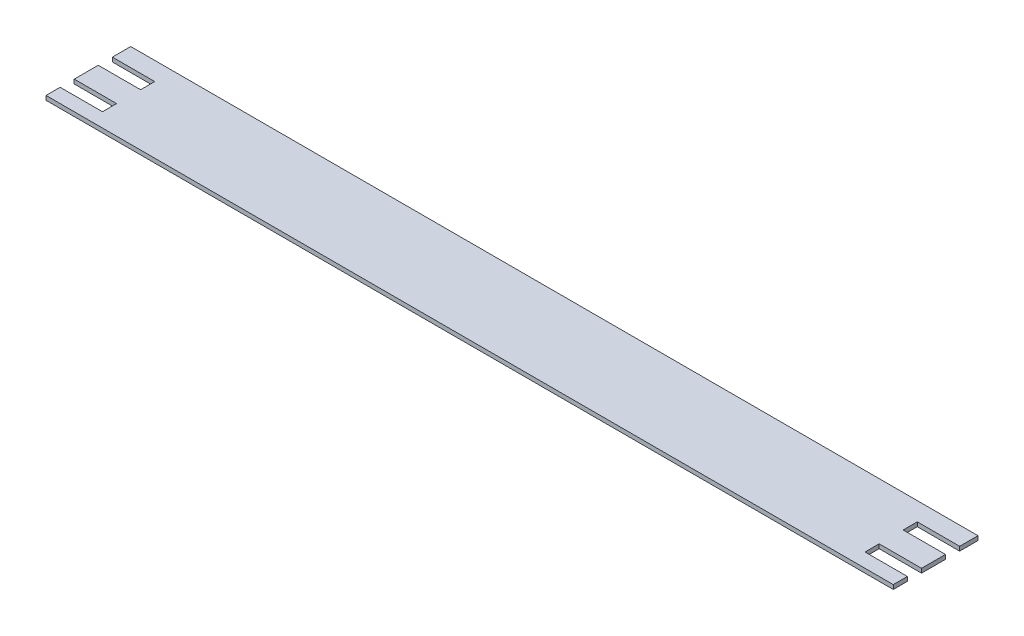
ISO-10303-21;
HEADER;
FILE_DESCRIPTION(('STEP AP214'),'2;1');
FILE_NAME('part.step','',(''),(''),'','','');
FILE_SCHEMA(('AUTOMOTIVE_DESIGN { 1 0 10303 214 1 1 1 1 }'));
ENDSEC;
DATA;
#1=APPLICATION_CONTEXT('core data for automotive mechanical design processes');
#2=APPLICATION_PROTOCOL_DEFINITION('international standard','automotive_design',2000,#1);
#3=PRODUCT_CONTEXT('',#1,'mechanical');
#4=PRODUCT('Part','Part','',(#3));
#5=PRODUCT_RELATED_PRODUCT_CATEGORY('part','',(#4));
#6=PRODUCT_DEFINITION_FORMATION('','',#4);
#7=PRODUCT_DEFINITION_CONTEXT('part definition',#1,'design');
#8=PRODUCT_DEFINITION('design','',#6,#7);
#9=PRODUCT_DEFINITION_SHAPE('','',#8);
#10=(LENGTH_UNIT() NAMED_UNIT(*) SI_UNIT(.MILLI.,.METRE.));
#11=(NAMED_UNIT(*) PLANE_ANGLE_UNIT() SI_UNIT($,.RADIAN.));
#12=(NAMED_UNIT(*) SI_UNIT($,.STERADIAN.) SOLID_ANGLE_UNIT());
#13=UNCERTAINTY_MEASURE_WITH_UNIT(LENGTH_MEASURE(1.E-05),#10,'distance_accuracy_value','');
#14=(GEOMETRIC_REPRESENTATION_CONTEXT(3) GLOBAL_UNCERTAINTY_ASSIGNED_CONTEXT((#13)) GLOBAL_UNIT_ASSIGNED_CONTEXT((#10,
#11,#12)) REPRESENTATION_CONTEXT('',''));
#15=CARTESIAN_POINT('',(0.,0.,0.));
#16=DIRECTION('',(0.,0.,1.));
#17=DIRECTION('',(1.,0.,0.));
#18=AXIS2_PLACEMENT_3D('',#15,#16,#17);
#19=CARTESIAN_POINT('',(-300.,46.99,23.));
#20=DIRECTION('',(0.,0.,1.));
#21=DIRECTION('',(1.,0.,0.));
#22=AXIS2_PLACEMENT_3D('',#19,#20,#21);
#23=PLANE('',#22);
#24=DIRECTION('',(0.,1.,0.));
#25=VECTOR('',#24,1.);
#26=CARTESIAN_POINT('',(-300.,0.,23.));
#27=LINE('',#26,#25);
#28=CARTESIAN_POINT('',(-300.,47.,23.));
#29=VERTEX_POINT('',#28);
#30=CARTESIAN_POINT('',(-300.,50.,23.));
#31=VERTEX_POINT('',#30);
#32=EDGE_CURVE('E196',#29,#31,#27,.T.);
#33=ORIENTED_EDGE('',*,*,#32,.T.);
#34=DIRECTION('',(-1.,0.,0.));
#35=VECTOR('',#34,1.);
#36=CARTESIAN_POINT('',(-300.,50.,23.));
#37=LINE('',#36,#35);
#38=CARTESIAN_POINT('',(-270.,50.,23.));
#39=VERTEX_POINT('',#38);
#40=EDGE_CURVE('E278',#39,#31,#37,.T.);
#41=ORIENTED_EDGE('',*,*,#40,.F.);
#42=DIRECTION('',(0.,1.,0.));
#43=VECTOR('',#42,1.);
#44=CARTESIAN_POINT('',(-270.,46.99,23.));
#45=LINE('',#44,#43);
#46=CARTESIAN_POINT('',(-270.,47.,23.));
#47=VERTEX_POINT('',#46);
#48=EDGE_CURVE('E258',#47,#39,#45,.T.);
#49=ORIENTED_EDGE('',*,*,#48,.F.);
#50=DIRECTION('',(1.,0.,0.));
#51=VECTOR('',#50,1.);
#52=CARTESIAN_POINT('',(300.,47.,22.9999999999999));
#53=LINE('',#52,#51);
#54=EDGE_CURVE('E269',#29,#47,#53,.T.);
#55=ORIENTED_EDGE('',*,*,#54,.F.);
#56=EDGE_LOOP('',(#33,#41,#49,#55));
#57=FACE_BOUND('',#56,.T.);
#58=ADVANCED_FACE('F35',(#57),#23,.F.);
#59=CARTESIAN_POINT('',(-300.,46.99,13.));
#60=DIRECTION('',(0.,0.,-1.));
#61=DIRECTION('',(-1.,0.,0.));
#62=AXIS2_PLACEMENT_3D('',#59,#60,#61);
#63=PLANE('',#62);
#64=DIRECTION('',(0.,1.,0.));
#65=VECTOR('',#64,1.);
#66=CARTESIAN_POINT('',(-270.,46.99,13.));
#67=LINE('',#66,#65);
#68=CARTESIAN_POINT('',(-270.,47.,13.));
#69=VERTEX_POINT('',#68);
#70=CARTESIAN_POINT('',(-270.,50.,13.));
#71=VERTEX_POINT('',#70);
#72=EDGE_CURVE('E39',#69,#71,#67,.T.);
#73=ORIENTED_EDGE('',*,*,#72,.T.);
#74=DIRECTION('',(1.,0.,0.));
#75=VECTOR('',#74,1.);
#76=CARTESIAN_POINT('',(-300.,50.,13.));
#77=LINE('',#76,#75);
#78=CARTESIAN_POINT('',(-300.,50.,13.));
#79=VERTEX_POINT('',#78);
#80=EDGE_CURVE('E193',#79,#71,#77,.T.);
#81=ORIENTED_EDGE('',*,*,#80,.F.);
#82=DIRECTION('',(0.,-1.,0.));
#83=VECTOR('',#82,1.);
#84=CARTESIAN_POINT('',(-300.,0.,13.));
#85=LINE('',#84,#83);
#86=CARTESIAN_POINT('',(-300.,47.,13.));
#87=VERTEX_POINT('',#86);
#88=EDGE_CURVE('E191',#79,#87,#85,.T.);
#89=ORIENTED_EDGE('',*,*,#88,.T.);
#90=DIRECTION('',(-1.,0.,0.));
#91=VECTOR('',#90,1.);
#92=CARTESIAN_POINT('',(300.,47.,13.));
#93=LINE('',#92,#91);
#94=EDGE_CURVE('E177',#69,#87,#93,.T.);
#95=ORIENTED_EDGE('',*,*,#94,.F.);
#96=EDGE_LOOP('',(#73,#81,#89,#95));
#97=FACE_BOUND('',#96,.T.);
#98=ADVANCED_FACE('F192',(#97),#63,.F.);
#99=CARTESIAN_POINT('',(-270.,46.99,13.));
#100=DIRECTION('',(1.,0.,0.));
#101=DIRECTION('',(0.,0.,-1.));
#102=AXIS2_PLACEMENT_3D('',#99,#100,#101);
#103=PLANE('',#102);
#104=ORIENTED_EDGE('',*,*,#48,.T.);
#105=DIRECTION('',(0.,0.,1.));
#106=VECTOR('',#105,1.);
#107=CARTESIAN_POINT('',(-270.,50.,60.));
#108=LINE('',#107,#106);
#109=EDGE_CURVE('E372',#71,#39,#108,.T.);
#110=ORIENTED_EDGE('',*,*,#109,.F.);
#111=ORIENTED_EDGE('',*,*,#72,.F.);
#112=DIRECTION('',(0.,0.,-1.));
#113=VECTOR('',#112,1.);
#114=CARTESIAN_POINT('',(-270.,47.,3.));
#115=LINE('',#114,#113);
#116=EDGE_CURVE('E184',#47,#69,#115,.T.);
#117=ORIENTED_EDGE('',*,*,#116,.F.);
#118=EDGE_LOOP('',(#104,#110,#111,#117));
#119=FACE_BOUND('',#118,.T.);
#120=ADVANCED_FACE('F376',(#119),#103,.F.);
#121=CARTESIAN_POINT('',(-300.,46.99,50.));
#122=DIRECTION('',(0.,0.,1.));
#123=DIRECTION('',(1.,0.,0.));
#124=AXIS2_PLACEMENT_3D('',#121,#122,#123);
#125=PLANE('',#124);
#126=DIRECTION('',(0.,1.,0.));
#127=VECTOR('',#126,1.);
#128=CARTESIAN_POINT('',(-300.,0.,50.));
#129=LINE('',#128,#127);
#130=CARTESIAN_POINT('',(-300.,47.,50.));
#131=VERTEX_POINT('',#130);
#132=CARTESIAN_POINT('',(-300.,50.,50.));
#133=VERTEX_POINT('',#132);
#134=EDGE_CURVE('E197',#131,#133,#129,.T.);
#135=ORIENTED_EDGE('',*,*,#134,.T.);
#136=DIRECTION('',(-1.,0.,0.));
#137=VECTOR('',#136,1.);
#138=CARTESIAN_POINT('',(-300.,50.,50.));
#139=LINE('',#138,#137);
#140=CARTESIAN_POINT('',(-270.,50.,50.));
#141=VERTEX_POINT('',#140);
#142=EDGE_CURVE('E235',#141,#133,#139,.T.);
#143=ORIENTED_EDGE('',*,*,#142,.F.);
#144=DIRECTION('',(0.,1.,0.));
#145=VECTOR('',#144,1.);
#146=CARTESIAN_POINT('',(-270.,46.99,50.));
#147=LINE('',#146,#145);
#148=CARTESIAN_POINT('',(-270.,47.,50.));
#149=VERTEX_POINT('',#148);
#150=EDGE_CURVE('E318',#149,#141,#147,.T.);
#151=ORIENTED_EDGE('',*,*,#150,.F.);
#152=DIRECTION('',(1.,0.,0.));
#153=VECTOR('',#152,1.);
#154=CARTESIAN_POINT('',(300.,47.,50.));
#155=LINE('',#154,#153);
#156=EDGE_CURVE('E188',#131,#149,#155,.T.);
#157=ORIENTED_EDGE('',*,*,#156,.F.);
#158=EDGE_LOOP('',(#135,#143,#151,#157));
#159=FACE_BOUND('',#158,.T.);
#160=ADVANCED_FACE('F336',(#159),#125,.F.);
#161=CARTESIAN_POINT('',(-300.,46.99,40.));
#162=DIRECTION('',(0.,0.,-1.));
#163=DIRECTION('',(-1.,0.,0.));
#164=AXIS2_PLACEMENT_3D('',#161,#162,#163);
#165=PLANE('',#164);
#166=DIRECTION('',(0.,1.,0.));
#167=VECTOR('',#166,1.);
#168=CARTESIAN_POINT('',(-270.,46.99,40.));
#169=LINE('',#168,#167);
#170=CARTESIAN_POINT('',(-270.,47.,40.));
#171=VERTEX_POINT('',#170);
#172=CARTESIAN_POINT('',(-270.,50.,40.));
#173=VERTEX_POINT('',#172);
#174=EDGE_CURVE('E291',#171,#173,#169,.T.);
#175=ORIENTED_EDGE('',*,*,#174,.T.);
#176=DIRECTION('',(1.,0.,0.));
#177=VECTOR('',#176,1.);
#178=CARTESIAN_POINT('',(-300.,50.,40.));
#179=LINE('',#178,#177);
#180=CARTESIAN_POINT('',(-300.,50.,40.));
#181=VERTEX_POINT('',#180);
#182=EDGE_CURVE('E229',#181,#173,#179,.T.);
#183=ORIENTED_EDGE('',*,*,#182,.F.);
#184=DIRECTION('',(0.,-1.,0.));
#185=VECTOR('',#184,1.);
#186=CARTESIAN_POINT('',(-300.,0.,40.));
#187=LINE('',#186,#185);
#188=CARTESIAN_POINT('',(-300.,47.,40.));
#189=VERTEX_POINT('',#188);
#190=EDGE_CURVE('E245',#181,#189,#187,.T.);
#191=ORIENTED_EDGE('',*,*,#190,.T.);
#192=DIRECTION('',(-1.,0.,0.));
#193=VECTOR('',#192,1.);
#194=CARTESIAN_POINT('',(300.,47.,40.));
#195=LINE('',#194,#193);
#196=EDGE_CURVE('E237',#171,#189,#195,.T.);
#197=ORIENTED_EDGE('',*,*,#196,.F.);
#198=EDGE_LOOP('',(#175,#183,#191,#197));
#199=FACE_BOUND('',#198,.T.);
#200=ADVANCED_FACE('F326',(#199),#165,.F.);
#201=CARTESIAN_POINT('',(-270.,46.99,40.));
#202=DIRECTION('',(1.,0.,0.));
#203=DIRECTION('',(0.,0.,-1.));
#204=AXIS2_PLACEMENT_3D('',#201,#202,#203);
#205=PLANE('',#204);
#206=ORIENTED_EDGE('',*,*,#150,.T.);
#207=DIRECTION('',(0.,0.,1.));
#208=VECTOR('',#207,1.);
#209=CARTESIAN_POINT('',(-270.,50.,60.));
#210=LINE('',#209,#208);
#211=EDGE_CURVE('E232',#173,#141,#210,.T.);
#212=ORIENTED_EDGE('',*,*,#211,.F.);
#213=ORIENTED_EDGE('',*,*,#174,.F.);
#214=DIRECTION('',(0.,0.,-1.));
#215=VECTOR('',#214,1.);
#216=CARTESIAN_POINT('',(-270.,47.,3.));
#217=LINE('',#216,#215);
#218=EDGE_CURVE('E240',#149,#171,#217,.T.);
#219=ORIENTED_EDGE('',*,*,#218,.F.);
#220=EDGE_LOOP('',(#206,#212,#213,#219));
#221=FACE_BOUND('',#220,.T.);
#222=ADVANCED_FACE('F328',(#221),#205,.F.);
#223=CARTESIAN_POINT('',(300.,46.99,13.));
#224=DIRECTION('',(0.,0.,-1.));
#225=DIRECTION('',(-1.,0.,0.));
#226=AXIS2_PLACEMENT_3D('',#223,#224,#225);
#227=PLANE('',#226);
#228=DIRECTION('',(0.,-1.,0.));
#229=VECTOR('',#228,1.);
#230=CARTESIAN_POINT('',(300.,1.71683972880179E-13,13.));
#231=LINE('',#230,#229);
#232=CARTESIAN_POINT('',(300.,50.,13.));
#233=VERTEX_POINT('',#232);
#234=CARTESIAN_POINT('',(300.,47.,13.));
#235=VERTEX_POINT('',#234);
#236=EDGE_CURVE('E279',#233,#235,#231,.T.);
#237=ORIENTED_EDGE('',*,*,#236,.F.);
#238=DIRECTION('',(1.,0.,0.));
#239=VECTOR('',#238,1.);
#240=CARTESIAN_POINT('',(-300.,50.,13.));
#241=LINE('',#240,#239);
#242=CARTESIAN_POINT('',(270.,50.,13.));
#243=VERTEX_POINT('',#242);
#244=EDGE_CURVE('E270',#243,#233,#241,.T.);
#245=ORIENTED_EDGE('',*,*,#244,.F.);
#246=DIRECTION('',(0.,1.,0.));
#247=VECTOR('',#246,1.);
#248=CARTESIAN_POINT('',(270.,46.99,13.));
#249=LINE('',#248,#247);
#250=CARTESIAN_POINT('',(270.,47.,13.));
#251=VERTEX_POINT('',#250);
#252=EDGE_CURVE('E247',#251,#243,#249,.T.);
#253=ORIENTED_EDGE('',*,*,#252,.F.);
#254=DIRECTION('',(-1.,0.,0.));
#255=VECTOR('',#254,1.);
#256=CARTESIAN_POINT('',(300.,47.,13.));
#257=LINE('',#256,#255);
#258=EDGE_CURVE('E262',#235,#251,#257,.T.);
#259=ORIENTED_EDGE('',*,*,#258,.F.);
#260=EDGE_LOOP('',(#237,#245,#253,#259));
#261=FACE_BOUND('',#260,.T.);
#262=ADVANCED_FACE('F399',(#261),#227,.F.);
#263=CARTESIAN_POINT('',(300.,46.99,23.));
#264=DIRECTION('',(0.,0.,1.));
#265=DIRECTION('',(1.,0.,0.));
#266=AXIS2_PLACEMENT_3D('',#263,#264,#265);
#267=PLANE('',#266);
#268=DIRECTION('',(0.,1.,0.));
#269=VECTOR('',#268,1.);
#270=CARTESIAN_POINT('',(270.,46.99,23.));
#271=LINE('',#270,#269);
#272=CARTESIAN_POINT('',(270.,47.,23.));
#273=VERTEX_POINT('',#272);
#274=CARTESIAN_POINT('',(270.,50.,23.));
#275=VERTEX_POINT('',#274);
#276=EDGE_CURVE('E251',#273,#275,#271,.T.);
#277=ORIENTED_EDGE('',*,*,#276,.T.);
#278=DIRECTION('',(-1.,0.,0.));
#279=VECTOR('',#278,1.);
#280=CARTESIAN_POINT('',(-300.,50.,23.));
#281=LINE('',#280,#279);
#282=CARTESIAN_POINT('',(300.,50.,23.));
#283=VERTEX_POINT('',#282);
#284=EDGE_CURVE('E276',#283,#275,#281,.T.);
#285=ORIENTED_EDGE('',*,*,#284,.F.);
#286=DIRECTION('',(0.,1.,0.));
#287=VECTOR('',#286,1.);
#288=CARTESIAN_POINT('',(300.,1.71683972880179E-13,23.));
#289=LINE('',#288,#287);
#290=CARTESIAN_POINT('',(300.,47.,23.));
#291=VERTEX_POINT('',#290);
#292=EDGE_CURVE('E282',#291,#283,#289,.T.);
#293=ORIENTED_EDGE('',*,*,#292,.F.);
#294=DIRECTION('',(1.,0.,0.));
#295=VECTOR('',#294,1.);
#296=CARTESIAN_POINT('',(300.,47.,23.));
#297=LINE('',#296,#295);
#298=EDGE_CURVE('E267',#273,#291,#297,.T.);
#299=ORIENTED_EDGE('',*,*,#298,.F.);
#300=EDGE_LOOP('',(#277,#285,#293,#299));
#301=FACE_BOUND('',#300,.T.);
#302=ADVANCED_FACE('F404',(#301),#267,.F.);
#303=CARTESIAN_POINT('',(270.,46.99,13.));
#304=DIRECTION('',(-1.,0.,0.));
#305=DIRECTION('',(0.,0.,1.));
#306=AXIS2_PLACEMENT_3D('',#303,#304,#305);
#307=PLANE('',#306);
#308=ORIENTED_EDGE('',*,*,#252,.T.);
#309=DIRECTION('',(0.,0.,-1.));
#310=VECTOR('',#309,1.);
#311=CARTESIAN_POINT('',(270.,50.,60.));
#312=LINE('',#311,#310);
#313=EDGE_CURVE('E272',#275,#243,#312,.T.);
#314=ORIENTED_EDGE('',*,*,#313,.F.);
#315=ORIENTED_EDGE('',*,*,#276,.F.);
#316=DIRECTION('',(0.,0.,1.));
#317=VECTOR('',#316,1.);
#318=CARTESIAN_POINT('',(270.,47.,3.));
#319=LINE('',#318,#317);
#320=EDGE_CURVE('E264',#251,#273,#319,.T.);
#321=ORIENTED_EDGE('',*,*,#320,.F.);
#322=EDGE_LOOP('',(#308,#314,#315,#321));
#323=FACE_BOUND('',#322,.T.);
#324=ADVANCED_FACE('F408',(#323),#307,.F.);
#325=CARTESIAN_POINT('',(300.,46.99,40.));
#326=DIRECTION('',(0.,0.,-1.));
#327=DIRECTION('',(-1.,0.,0.));
#328=AXIS2_PLACEMENT_3D('',#325,#326,#327);
#329=PLANE('',#328);
#330=DIRECTION('',(0.,-1.,0.));
#331=VECTOR('',#330,1.);
#332=CARTESIAN_POINT('',(300.,1.71683972880179E-13,40.));
#333=LINE('',#332,#331);
#334=CARTESIAN_POINT('',(300.,50.,40.));
#335=VERTEX_POINT('',#334);
#336=CARTESIAN_POINT('',(300.,47.,40.));
#337=VERTEX_POINT('',#336);
#338=EDGE_CURVE('E207',#335,#337,#333,.T.);
#339=ORIENTED_EDGE('',*,*,#338,.F.);
#340=DIRECTION('',(1.,0.,0.));
#341=VECTOR('',#340,1.);
#342=CARTESIAN_POINT('',(-300.,50.,40.));
#343=LINE('',#342,#341);
#344=CARTESIAN_POINT('',(270.,50.,40.));
#345=VERTEX_POINT('',#344);
#346=EDGE_CURVE('E231',#345,#335,#343,.T.);
#347=ORIENTED_EDGE('',*,*,#346,.F.);
#348=DIRECTION('',(0.,1.,0.));
#349=VECTOR('',#348,1.);
#350=CARTESIAN_POINT('',(270.,46.99,40.));
#351=LINE('',#350,#349);
#352=CARTESIAN_POINT('',(270.,47.,40.));
#353=VERTEX_POINT('',#352);
#354=EDGE_CURVE('E288',#353,#345,#351,.T.);
#355=ORIENTED_EDGE('',*,*,#354,.F.);
#356=DIRECTION('',(-1.,0.,0.));
#357=VECTOR('',#356,1.);
#358=CARTESIAN_POINT('',(300.,47.,40.));
#359=LINE('',#358,#357);
#360=EDGE_CURVE('E239',#337,#353,#359,.T.);
#361=ORIENTED_EDGE('',*,*,#360,.F.);
#362=EDGE_LOOP('',(#339,#347,#355,#361));
#363=FACE_BOUND('',#362,.T.);
#364=ADVANCED_FACE('F359',(#363),#329,.F.);
#365=CARTESIAN_POINT('',(300.,46.99,50.));
#366=DIRECTION('',(0.,0.,1.));
#367=DIRECTION('',(1.,0.,0.));
#368=AXIS2_PLACEMENT_3D('',#365,#366,#367);
#369=PLANE('',#368);
#370=DIRECTION('',(0.,1.,0.));
#371=VECTOR('',#370,1.);
#372=CARTESIAN_POINT('',(270.,46.99,50.));
#373=LINE('',#372,#371);
#374=CARTESIAN_POINT('',(270.,47.,50.));
#375=VERTEX_POINT('',#374);
#376=CARTESIAN_POINT('',(270.,50.,50.));
#377=VERTEX_POINT('',#376);
#378=EDGE_CURVE('E285',#375,#377,#373,.T.);
#379=ORIENTED_EDGE('',*,*,#378,.T.);
#380=DIRECTION('',(-1.,0.,0.));
#381=VECTOR('',#380,1.);
#382=CARTESIAN_POINT('',(-300.,50.,50.));
#383=LINE('',#382,#381);
#384=CARTESIAN_POINT('',(300.,50.,50.));
#385=VERTEX_POINT('',#384);
#386=EDGE_CURVE('E283',#385,#377,#383,.T.);
#387=ORIENTED_EDGE('',*,*,#386,.F.);
#388=DIRECTION('',(0.,1.,0.));
#389=VECTOR('',#388,1.);
#390=CARTESIAN_POINT('',(300.,1.71683972880179E-13,50.));
#391=LINE('',#390,#389);
#392=CARTESIAN_POINT('',(300.,47.,50.));
#393=VERTEX_POINT('',#392);
#394=EDGE_CURVE('E204',#393,#385,#391,.T.);
#395=ORIENTED_EDGE('',*,*,#394,.F.);
#396=DIRECTION('',(1.,0.,0.));
#397=VECTOR('',#396,1.);
#398=CARTESIAN_POINT('',(300.,47.,50.));
#399=LINE('',#398,#397);
#400=EDGE_CURVE('E273',#375,#393,#399,.T.);
#401=ORIENTED_EDGE('',*,*,#400,.F.);
#402=EDGE_LOOP('',(#379,#387,#395,#401));
#403=FACE_BOUND('',#402,.T.);
#404=ADVANCED_FACE('F348',(#403),#369,.F.);
#405=CARTESIAN_POINT('',(270.,46.99,40.));
#406=DIRECTION('',(-1.,0.,0.));
#407=DIRECTION('',(0.,0.,1.));
#408=AXIS2_PLACEMENT_3D('',#405,#406,#407);
#409=PLANE('',#408);
#410=ORIENTED_EDGE('',*,*,#354,.T.);
#411=DIRECTION('',(0.,0.,-1.));
#412=VECTOR('',#411,1.);
#413=CARTESIAN_POINT('',(270.,50.,60.));
#414=LINE('',#413,#412);
#415=EDGE_CURVE('E307',#377,#345,#414,.T.);
#416=ORIENTED_EDGE('',*,*,#415,.F.);
#417=ORIENTED_EDGE('',*,*,#378,.F.);
#418=DIRECTION('',(0.,0.,1.));
#419=VECTOR('',#418,1.);
#420=CARTESIAN_POINT('',(270.,47.,3.));
#421=LINE('',#420,#419);
#422=EDGE_CURVE('E302',#353,#375,#421,.T.);
#423=ORIENTED_EDGE('',*,*,#422,.F.);
#424=EDGE_LOOP('',(#410,#416,#417,#423));
#425=FACE_BOUND('',#424,.T.);
#426=ADVANCED_FACE('F353',(#425),#409,.F.);
#427=CARTESIAN_POINT('',(-300.,0.,0.));
#428=DIRECTION('',(0.,0.,1.));
#429=DIRECTION('',(1.,0.,0.));
#430=AXIS2_PLACEMENT_3D('',#427,#428,#429);
#431=PLANE('',#430);
#432=DIRECTION('',(0.,-1.,0.));
#433=VECTOR('',#432,1.);
#434=CARTESIAN_POINT('',(-300.,0.,0.));
#435=LINE('',#434,#433);
#436=CARTESIAN_POINT('',(-300.,50.,0.));
#437=VERTEX_POINT('',#436);
#438=CARTESIAN_POINT('',(-300.,47.,0.));
#439=VERTEX_POINT('',#438);
#440=EDGE_CURVE('E202',#437,#439,#435,.T.);
#441=ORIENTED_EDGE('',*,*,#440,.F.);
#442=DIRECTION('',(-1.,0.,0.));
#443=VECTOR('',#442,1.);
#444=CARTESIAN_POINT('',(-300.,50.,0.));
#445=LINE('',#444,#443);
#446=CARTESIAN_POINT('',(300.,50.,0.));
#447=VERTEX_POINT('',#446);
#448=EDGE_CURVE('E295',#447,#437,#445,.T.);
#449=ORIENTED_EDGE('',*,*,#448,.F.);
#450=DIRECTION('',(0.,-1.,0.));
#451=VECTOR('',#450,1.);
#452=CARTESIAN_POINT('',(300.,3.43367945760358E-13,0.));
#453=LINE('',#452,#451);
#454=CARTESIAN_POINT('',(300.,47.,0.));
#455=VERTEX_POINT('',#454);
#456=EDGE_CURVE('E216',#447,#455,#453,.T.);
#457=ORIENTED_EDGE('',*,*,#456,.T.);
#458=DIRECTION('',(1.,0.,0.));
#459=VECTOR('',#458,1.);
#460=CARTESIAN_POINT('',(-300.,47.,0.));
#461=LINE('',#460,#459);
#462=EDGE_CURVE('E218',#439,#455,#461,.T.);
#463=ORIENTED_EDGE('',*,*,#462,.F.);
#464=EDGE_LOOP('',(#441,#449,#457,#463));
#465=FACE_BOUND('',#464,.T.);
#466=ADVANCED_FACE('F387',(#465),#431,.F.);
#467=CARTESIAN_POINT('',(-300.,0.,60.));
#468=DIRECTION('',(0.,0.,1.));
#469=DIRECTION('',(1.,0.,0.));
#470=AXIS2_PLACEMENT_3D('',#467,#468,#469);
#471=PLANE('',#470);
#472=DIRECTION('',(-1.,0.,0.));
#473=VECTOR('',#472,1.);
#474=CARTESIAN_POINT('',(-300.,50.,60.));
#475=LINE('',#474,#473);
#476=CARTESIAN_POINT('',(300.,50.,60.));
#477=VERTEX_POINT('',#476);
#478=CARTESIAN_POINT('',(-300.,50.,60.));
#479=VERTEX_POINT('',#478);
#480=EDGE_CURVE('E224',#477,#479,#475,.T.);
#481=ORIENTED_EDGE('',*,*,#480,.T.);
#482=DIRECTION('',(0.,-1.,0.));
#483=VECTOR('',#482,1.);
#484=CARTESIAN_POINT('',(-300.,0.,60.));
#485=LINE('',#484,#483);
#486=CARTESIAN_POINT('',(-300.,47.,60.));
#487=VERTEX_POINT('',#486);
#488=EDGE_CURVE('E44',#479,#487,#485,.T.);
#489=ORIENTED_EDGE('',*,*,#488,.T.);
#490=DIRECTION('',(-1.,0.,0.));
#491=VECTOR('',#490,1.);
#492=CARTESIAN_POINT('',(300.,47.,60.));
#493=LINE('',#492,#491);
#494=CARTESIAN_POINT('',(300.,47.,60.));
#495=VERTEX_POINT('',#494);
#496=EDGE_CURVE('E225',#495,#487,#493,.T.);
#497=ORIENTED_EDGE('',*,*,#496,.F.);
#498=DIRECTION('',(0.,-1.,0.));
#499=VECTOR('',#498,1.);
#500=CARTESIAN_POINT('',(300.,3.43367945760358E-13,60.));
#501=LINE('',#500,#499);
#502=EDGE_CURVE('E11',#477,#495,#501,.T.);
#503=ORIENTED_EDGE('',*,*,#502,.F.);
#504=EDGE_LOOP('',(#481,#489,#497,#503));
#505=FACE_BOUND('',#504,.T.);
#506=ADVANCED_FACE('F342',(#505),#471,.T.);
#507=CARTESIAN_POINT('',(-300.,50.,60.));
#508=DIRECTION('',(0.,-1.,0.));
#509=DIRECTION('',(0.,0.,-1.));
#510=AXIS2_PLACEMENT_3D('',#507,#508,#509);
#511=PLANE('',#510);
#512=ORIENTED_EDGE('',*,*,#313,.T.);
#513=ORIENTED_EDGE('',*,*,#244,.T.);
#514=DIRECTION('',(0.,0.,-1.));
#515=VECTOR('',#514,1.);
#516=CARTESIAN_POINT('',(300.,50.,60.));
#517=LINE('',#516,#515);
#518=EDGE_CURVE('E300',#233,#447,#517,.T.);
#519=ORIENTED_EDGE('',*,*,#518,.T.);
#520=ORIENTED_EDGE('',*,*,#448,.T.);
#521=DIRECTION('',(0.,0.,-1.));
#522=VECTOR('',#521,1.);
#523=CARTESIAN_POINT('',(-300.,50.,60.));
#524=LINE('',#523,#522);
#525=EDGE_CURVE('E212',#79,#437,#524,.T.);
#526=ORIENTED_EDGE('',*,*,#525,.F.);
#527=ORIENTED_EDGE('',*,*,#80,.T.);
#528=ORIENTED_EDGE('',*,*,#109,.T.);
#529=ORIENTED_EDGE('',*,*,#40,.T.);
#530=EDGE_CURVE('E211',#181,#31,#524,.T.);
#531=ORIENTED_EDGE('',*,*,#530,.F.);
#532=ORIENTED_EDGE('',*,*,#182,.T.);
#533=ORIENTED_EDGE('',*,*,#211,.T.);
#534=ORIENTED_EDGE('',*,*,#142,.T.);
#535=EDGE_CURVE('E60',#479,#133,#524,.T.);
#536=ORIENTED_EDGE('',*,*,#535,.F.);
#537=ORIENTED_EDGE('',*,*,#480,.F.);
#538=EDGE_CURVE('E296',#477,#385,#517,.T.);
#539=ORIENTED_EDGE('',*,*,#538,.T.);
#540=ORIENTED_EDGE('',*,*,#386,.T.);
#541=ORIENTED_EDGE('',*,*,#415,.T.);
#542=ORIENTED_EDGE('',*,*,#346,.T.);
#543=EDGE_CURVE('E299',#335,#283,#517,.T.);
#544=ORIENTED_EDGE('',*,*,#543,.T.);
#545=ORIENTED_EDGE('',*,*,#284,.T.);
#546=EDGE_LOOP('',(#512,#513,#519,#520,#526,#527,#528,#529,#531,#532,#533,#534,#536,#537,#539,
#540,#541,#542,#544,#545));
#547=FACE_BOUND('',#546,.T.);
#548=ADVANCED_FACE('F329',(#547),#511,.F.);
#549=CARTESIAN_POINT('',(300.,47.,3.));
#550=DIRECTION('',(0.,1.,0.));
#551=DIRECTION('',(0.,0.,1.));
#552=AXIS2_PLACEMENT_3D('',#549,#550,#551);
#553=PLANE('',#552);
#554=DIRECTION('',(0.,0.,1.));
#555=VECTOR('',#554,1.);
#556=CARTESIAN_POINT('',(300.,47.,3.));
#557=LINE('',#556,#555);
#558=EDGE_CURVE('E292',#455,#235,#557,.T.);
#559=ORIENTED_EDGE('',*,*,#558,.T.);
#560=ORIENTED_EDGE('',*,*,#258,.T.);
#561=ORIENTED_EDGE('',*,*,#320,.T.);
#562=ORIENTED_EDGE('',*,*,#298,.T.);
#563=EDGE_CURVE('E294',#291,#337,#557,.T.);
#564=ORIENTED_EDGE('',*,*,#563,.T.);
#565=ORIENTED_EDGE('',*,*,#360,.T.);
#566=ORIENTED_EDGE('',*,*,#422,.T.);
#567=ORIENTED_EDGE('',*,*,#400,.T.);
#568=EDGE_CURVE('E227',#393,#495,#557,.T.);
#569=ORIENTED_EDGE('',*,*,#568,.T.);
#570=ORIENTED_EDGE('',*,*,#496,.T.);
#571=DIRECTION('',(0.,0.,1.));
#572=VECTOR('',#571,1.);
#573=CARTESIAN_POINT('',(-300.,47.,3.));
#574=LINE('',#573,#572);
#575=EDGE_CURVE('E52',#131,#487,#574,.T.);
#576=ORIENTED_EDGE('',*,*,#575,.F.);
#577=ORIENTED_EDGE('',*,*,#156,.T.);
#578=ORIENTED_EDGE('',*,*,#218,.T.);
#579=ORIENTED_EDGE('',*,*,#196,.T.);
#580=EDGE_CURVE('E203',#29,#189,#574,.T.);
#581=ORIENTED_EDGE('',*,*,#580,.F.);
#582=ORIENTED_EDGE('',*,*,#54,.T.);
#583=ORIENTED_EDGE('',*,*,#116,.T.);
#584=ORIENTED_EDGE('',*,*,#94,.T.);
#585=EDGE_CURVE('E182',#439,#87,#574,.T.);
#586=ORIENTED_EDGE('',*,*,#585,.F.);
#587=ORIENTED_EDGE('',*,*,#462,.T.);
#588=EDGE_LOOP('',(#559,#560,#561,#562,#564,#565,#566,#567,#569,#570,#576,#577,#578,#579,#581,
#582,#583,#584,#586,#587));
#589=FACE_BOUND('',#588,.T.);
#590=ADVANCED_FACE('F37',(#589),#553,.F.);
#591=CARTESIAN_POINT('',(300.,1.71683972880179E-13,0.));
#592=DIRECTION('',(-1.,0.,0.));
#593=DIRECTION('',(0.,-1.,0.));
#594=AXIS2_PLACEMENT_3D('',#591,#592,#593);
#595=PLANE('',#594);
#596=ORIENTED_EDGE('',*,*,#568,.F.);
#597=ORIENTED_EDGE('',*,*,#394,.T.);
#598=ORIENTED_EDGE('',*,*,#538,.F.);
#599=ORIENTED_EDGE('',*,*,#502,.T.);
#600=EDGE_LOOP('',(#596,#597,#598,#599));
#601=FACE_BOUND('',#600,.T.);
#602=ADVANCED_FACE('F345',(#601),#595,.F.);
#603=ORIENTED_EDGE('',*,*,#563,.F.);
#604=ORIENTED_EDGE('',*,*,#292,.T.);
#605=ORIENTED_EDGE('',*,*,#543,.F.);
#606=ORIENTED_EDGE('',*,*,#338,.T.);
#607=EDGE_LOOP('',(#603,#604,#605,#606));
#608=FACE_BOUND('',#607,.T.);
#609=ADVANCED_FACE('F363',(#608),#595,.F.);
#610=ORIENTED_EDGE('',*,*,#518,.F.);
#611=ORIENTED_EDGE('',*,*,#236,.T.);
#612=ORIENTED_EDGE('',*,*,#558,.F.);
#613=ORIENTED_EDGE('',*,*,#456,.F.);
#614=EDGE_LOOP('',(#610,#611,#612,#613));
#615=FACE_BOUND('',#614,.T.);
#616=ADVANCED_FACE('F419',(#615),#595,.F.);
#617=CARTESIAN_POINT('',(-300.,0.,0.));
#618=DIRECTION('',(-1.,0.,0.));
#619=DIRECTION('',(0.,0.,1.));
#620=AXIS2_PLACEMENT_3D('',#617,#618,#619);
#621=PLANE('',#620);
#622=ORIENTED_EDGE('',*,*,#32,.F.);
#623=ORIENTED_EDGE('',*,*,#580,.T.);
#624=ORIENTED_EDGE('',*,*,#190,.F.);
#625=ORIENTED_EDGE('',*,*,#530,.T.);
#626=EDGE_LOOP('',(#622,#623,#624,#625));
#627=FACE_BOUND('',#626,.T.);
#628=ADVANCED_FACE('F333',(#627),#621,.T.);
#629=ORIENTED_EDGE('',*,*,#134,.F.);
#630=ORIENTED_EDGE('',*,*,#575,.T.);
#631=ORIENTED_EDGE('',*,*,#488,.F.);
#632=ORIENTED_EDGE('',*,*,#535,.T.);
#633=EDGE_LOOP('',(#629,#630,#631,#632));
#634=FACE_BOUND('',#633,.T.);
#635=ADVANCED_FACE('F337',(#634),#621,.T.);
#636=ORIENTED_EDGE('',*,*,#88,.F.);
#637=ORIENTED_EDGE('',*,*,#525,.T.);
#638=ORIENTED_EDGE('',*,*,#440,.T.);
#639=ORIENTED_EDGE('',*,*,#585,.T.);
#640=EDGE_LOOP('',(#636,#637,#638,#639));
#641=FACE_BOUND('',#640,.T.);
#642=ADVANCED_FACE('F200',(#641),#621,.T.);
#643=CLOSED_SHELL('',(#58,#98,#120,#160,#200,#222,#262,#302,#324,#364,#404,#426,#466,#506,#548,
#590,#602,#609,#616,#628,#635,#642));
#644=MANIFOLD_SOLID_BREP('B2',#643);
#645=ADVANCED_BREP_SHAPE_REPRESENTATION('',(#18,#644),#14);
#646=SHAPE_DEFINITION_REPRESENTATION(#9,#645);
ENDSEC;
END-ISO-10303-21;
